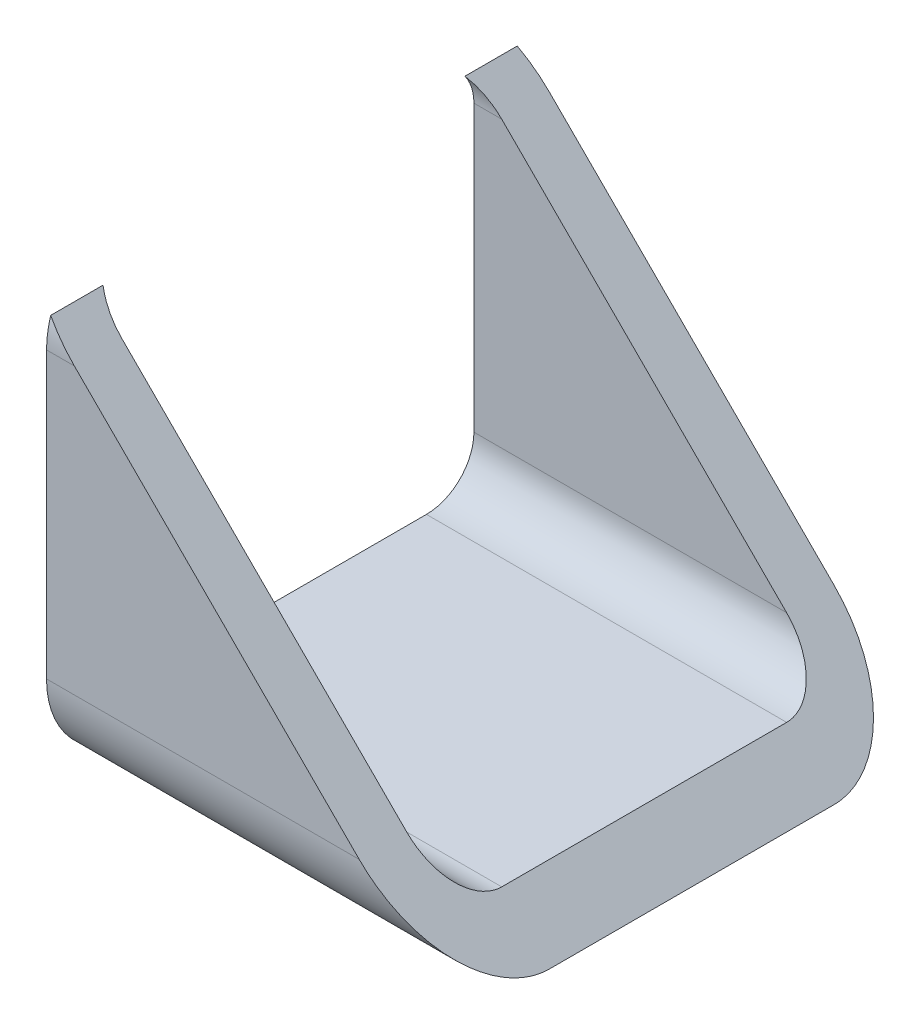
ISO-10303-21;
HEADER;
FILE_DESCRIPTION(('STEP AP214'),'2;1');
FILE_NAME('part.step','',(''),(''),'','','');
FILE_SCHEMA(('AUTOMOTIVE_DESIGN { 1 0 10303 214 1 1 1 1 }'));
ENDSEC;
DATA;
#1=APPLICATION_CONTEXT('core data for automotive mechanical design processes');
#2=APPLICATION_PROTOCOL_DEFINITION('international standard','automotive_design',2000,#1);
#3=PRODUCT_CONTEXT('',#1,'mechanical');
#4=PRODUCT('Part','Part','',(#3));
#5=PRODUCT_RELATED_PRODUCT_CATEGORY('part','',(#4));
#6=PRODUCT_DEFINITION_FORMATION('','',#4);
#7=PRODUCT_DEFINITION_CONTEXT('part definition',#1,'design');
#8=PRODUCT_DEFINITION('design','',#6,#7);
#9=PRODUCT_DEFINITION_SHAPE('','',#8);
#10=(LENGTH_UNIT() NAMED_UNIT(*) SI_UNIT(.MILLI.,.METRE.));
#11=(NAMED_UNIT(*) PLANE_ANGLE_UNIT() SI_UNIT($,.RADIAN.));
#12=(NAMED_UNIT(*) SI_UNIT($,.STERADIAN.) SOLID_ANGLE_UNIT());
#13=UNCERTAINTY_MEASURE_WITH_UNIT(LENGTH_MEASURE(1.E-05),#10,'distance_accuracy_value','');
#14=(GEOMETRIC_REPRESENTATION_CONTEXT(3) GLOBAL_UNCERTAINTY_ASSIGNED_CONTEXT((#13)) GLOBAL_UNIT_ASSIGNED_CONTEXT((#10,
#11,#12)) REPRESENTATION_CONTEXT('',''));
#15=CARTESIAN_POINT('',(0.,0.,0.));
#16=DIRECTION('',(0.,0.,1.));
#17=DIRECTION('',(1.,0.,0.));
#18=AXIS2_PLACEMENT_3D('',#15,#16,#17);
#19=CARTESIAN_POINT('',(40.,12.,-12.));
#20=DIRECTION('',(-1.,0.,0.));
#21=DIRECTION('',(0.,0.,1.));
#22=AXIS2_PLACEMENT_3D('',#19,#20,#21);
#23=CYLINDRICAL_SURFACE('',#22,8.);
#24=CARTESIAN_POINT('',(0.,12.,-12.));
#25=DIRECTION('',(1.,0.,0.));
#26=DIRECTION('',(0.,0.,-1.));
#27=AXIS2_PLACEMENT_3D('',#24,#25,#26);
#28=CIRCLE('',#27,8.);
#29=CARTESIAN_POINT('',(0.,12.,-20.));
#30=VERTEX_POINT('',#29);
#31=CARTESIAN_POINT('',(0.,14.3431457505076,-19.6491612606794));
#32=VERTEX_POINT('',#31);
#33=EDGE_CURVE('E186',#30,#32,#28,.T.);
#34=ORIENTED_EDGE('',*,*,#33,.T.);
#35=CARTESIAN_POINT('',(2.34314575050762,12.,-12.));
#36=DIRECTION('',(-0.707106781186547,-0.707106781186548,0.));
#37=DIRECTION('',(-0.707106781186548,0.707106781186547,0.));
#38=AXIS2_PLACEMENT_3D('',#35,#36,#37);
#39=ELLIPSE('',#38,11.3137084989848,8.);
#40=CARTESIAN_POINT('',(2.34314575050762,12.,-20.));
#41=VERTEX_POINT('',#40);
#42=EDGE_CURVE('E79',#41,#32,#39,.F.);
#43=ORIENTED_EDGE('',*,*,#42,.F.);
#44=DIRECTION('',(-1.,0.,0.));
#45=VECTOR('',#44,1.);
#46=CARTESIAN_POINT('',(40.,12.,-20.));
#47=LINE('',#46,#45);
#48=EDGE_CURVE('E86',#41,#30,#47,.T.);
#49=ORIENTED_EDGE('',*,*,#48,.T.);
#50=EDGE_LOOP('',(#34,#43,#49));
#51=FACE_BOUND('',#50,.T.);
#52=ADVANCED_FACE('F62',(#51),#23,.T.);
#53=CARTESIAN_POINT('',(40.,12.,12.));
#54=DIRECTION('',(-1.,0.,0.));
#55=DIRECTION('',(0.,0.,1.));
#56=AXIS2_PLACEMENT_3D('',#53,#54,#55);
#57=CYLINDRICAL_SURFACE('',#56,8.);
#58=DIRECTION('',(-1.,0.,0.));
#59=VECTOR('',#58,1.);
#60=CARTESIAN_POINT('',(40.,12.,20.));
#61=LINE('',#60,#59);
#62=CARTESIAN_POINT('',(2.34314575050762,12.,20.));
#63=VERTEX_POINT('',#62);
#64=CARTESIAN_POINT('',(0.,12.,20.));
#65=VERTEX_POINT('',#64);
#66=EDGE_CURVE('E12',#63,#65,#61,.T.);
#67=ORIENTED_EDGE('',*,*,#66,.F.);
#68=CARTESIAN_POINT('',(2.34314575050762,12.,12.));
#69=DIRECTION('',(-0.707106781186547,-0.707106781186548,0.));
#70=DIRECTION('',(-0.707106781186548,0.707106781186547,0.));
#71=AXIS2_PLACEMENT_3D('',#68,#69,#70);
#72=ELLIPSE('',#71,11.3137084989848,8.);
#73=CARTESIAN_POINT('',(0.,14.3431457505076,19.6491612606794));
#74=VERTEX_POINT('',#73);
#75=EDGE_CURVE('E163',#74,#63,#72,.F.);
#76=ORIENTED_EDGE('',*,*,#75,.F.);
#77=CARTESIAN_POINT('',(0.,12.,12.));
#78=DIRECTION('',(1.,0.,0.));
#79=DIRECTION('',(0.,0.,-1.));
#80=AXIS2_PLACEMENT_3D('',#77,#78,#79);
#81=CIRCLE('',#80,8.);
#82=EDGE_CURVE('E182',#74,#65,#81,.T.);
#83=ORIENTED_EDGE('',*,*,#82,.T.);
#84=EDGE_LOOP('',(#67,#76,#83));
#85=FACE_BOUND('',#84,.T.);
#86=ADVANCED_FACE('F181',(#85),#57,.T.);
#87=CARTESIAN_POINT('',(40.,-12.,20.));
#88=DIRECTION('',(0.,0.,-1.));
#89=DIRECTION('',(-1.,0.,0.));
#90=AXIS2_PLACEMENT_3D('',#87,#88,#89);
#91=PLANE('',#90);
#92=DIRECTION('',(-1.,0.,0.));
#93=VECTOR('',#92,1.);
#94=CARTESIAN_POINT('',(40.,-12.,20.));
#95=LINE('',#94,#93);
#96=CARTESIAN_POINT('',(26.3431457505076,-12.,20.));
#97=VERTEX_POINT('',#96);
#98=CARTESIAN_POINT('',(0.,-12.,20.));
#99=VERTEX_POINT('',#98);
#100=EDGE_CURVE('E71',#97,#99,#95,.T.);
#101=ORIENTED_EDGE('',*,*,#100,.F.);
#102=DIRECTION('',(0.707106781186548,-0.707106781186547,0.));
#103=VECTOR('',#102,1.);
#104=CARTESIAN_POINT('',(-9.65685424949238,24.,20.));
#105=LINE('',#104,#103);
#106=EDGE_CURVE('E166',#63,#97,#105,.T.);
#107=ORIENTED_EDGE('',*,*,#106,.F.);
#108=ORIENTED_EDGE('',*,*,#66,.T.);
#109=DIRECTION('',(0.,-1.,0.));
#110=VECTOR('',#109,1.);
#111=CARTESIAN_POINT('',(0.,-12.,20.));
#112=LINE('',#111,#110);
#113=EDGE_CURVE('E185',#65,#99,#112,.T.);
#114=ORIENTED_EDGE('',*,*,#113,.T.);
#115=EDGE_LOOP('',(#101,#107,#108,#114));
#116=FACE_BOUND('',#115,.T.);
#117=ADVANCED_FACE('F178',(#116),#91,.F.);
#118=CARTESIAN_POINT('',(40.,-12.,12.));
#119=DIRECTION('',(-1.,0.,0.));
#120=DIRECTION('',(0.,0.,1.));
#121=AXIS2_PLACEMENT_3D('',#118,#119,#120);
#122=CYLINDRICAL_SURFACE('',#121,8.);
#123=DIRECTION('',(-1.,0.,0.));
#124=VECTOR('',#123,1.);
#125=CARTESIAN_POINT('',(40.,-20.,12.));
#126=LINE('',#125,#124);
#127=CARTESIAN_POINT('',(34.3431457505076,-20.,12.));
#128=VERTEX_POINT('',#127);
#129=CARTESIAN_POINT('',(0.,-20.,12.));
#130=VERTEX_POINT('',#129);
#131=EDGE_CURVE('E211',#128,#130,#126,.T.);
#132=ORIENTED_EDGE('',*,*,#131,.F.);
#133=CARTESIAN_POINT('',(26.3431457505076,-12.,12.));
#134=DIRECTION('',(-0.707106781186547,-0.707106781186548,0.));
#135=DIRECTION('',(-0.707106781186548,0.707106781186547,0.));
#136=AXIS2_PLACEMENT_3D('',#133,#134,#135);
#137=ELLIPSE('',#136,11.3137084989848,8.);
#138=EDGE_CURVE('E174',#97,#128,#137,.F.);
#139=ORIENTED_EDGE('',*,*,#138,.F.);
#140=ORIENTED_EDGE('',*,*,#100,.T.);
#141=CARTESIAN_POINT('',(0.,-12.,12.));
#142=DIRECTION('',(1.,0.,0.));
#143=DIRECTION('',(0.,0.,-1.));
#144=AXIS2_PLACEMENT_3D('',#141,#142,#143);
#145=CIRCLE('',#144,8.);
#146=EDGE_CURVE('E192',#99,#130,#145,.T.);
#147=ORIENTED_EDGE('',*,*,#146,.T.);
#148=EDGE_LOOP('',(#132,#139,#140,#147));
#149=FACE_BOUND('',#148,.T.);
#150=ADVANCED_FACE('F423',(#149),#122,.T.);
#151=CARTESIAN_POINT('',(40.,-20.,12.));
#152=DIRECTION('',(0.,1.,0.));
#153=DIRECTION('',(0.,0.,1.));
#154=AXIS2_PLACEMENT_3D('',#151,#152,#153);
#155=PLANE('',#154);
#156=DIRECTION('',(-1.,0.,0.));
#157=VECTOR('',#156,1.);
#158=CARTESIAN_POINT('',(40.,-20.,-12.));
#159=LINE('',#158,#157);
#160=CARTESIAN_POINT('',(34.3431457505076,-20.,-12.));
#161=VERTEX_POINT('',#160);
#162=CARTESIAN_POINT('',(0.,-20.,-12.));
#163=VERTEX_POINT('',#162);
#164=EDGE_CURVE('E209',#161,#163,#159,.T.);
#165=ORIENTED_EDGE('',*,*,#164,.F.);
#166=DIRECTION('',(0.,0.,-1.));
#167=VECTOR('',#166,1.);
#168=CARTESIAN_POINT('',(34.3431457505076,-20.,-20.001));
#169=LINE('',#168,#167);
#170=EDGE_CURVE('E286',#128,#161,#169,.T.);
#171=ORIENTED_EDGE('',*,*,#170,.F.);
#172=ORIENTED_EDGE('',*,*,#131,.T.);
#173=DIRECTION('',(0.,0.,-1.));
#174=VECTOR('',#173,1.);
#175=CARTESIAN_POINT('',(0.,-20.,12.));
#176=LINE('',#175,#174);
#177=EDGE_CURVE('E194',#130,#163,#176,.T.);
#178=ORIENTED_EDGE('',*,*,#177,.T.);
#179=EDGE_LOOP('',(#165,#171,#172,#178));
#180=FACE_BOUND('',#179,.T.);
#181=ADVANCED_FACE('F412',(#180),#155,.F.);
#182=CARTESIAN_POINT('',(40.,-12.,-12.));
#183=DIRECTION('',(-1.,0.,0.));
#184=DIRECTION('',(0.,0.,1.));
#185=AXIS2_PLACEMENT_3D('',#182,#183,#184);
#186=CYLINDRICAL_SURFACE('',#185,8.);
#187=DIRECTION('',(-1.,0.,0.));
#188=VECTOR('',#187,1.);
#189=CARTESIAN_POINT('',(40.,-12.,-20.));
#190=LINE('',#189,#188);
#191=CARTESIAN_POINT('',(26.3431457505076,-12.,-20.));
#192=VERTEX_POINT('',#191);
#193=CARTESIAN_POINT('',(0.,-12.,-20.));
#194=VERTEX_POINT('',#193);
#195=EDGE_CURVE('E207',#192,#194,#190,.T.);
#196=ORIENTED_EDGE('',*,*,#195,.F.);
#197=CARTESIAN_POINT('',(26.3431457505076,-12.,-12.));
#198=DIRECTION('',(-0.707106781186547,-0.707106781186548,0.));
#199=DIRECTION('',(-0.707106781186548,0.707106781186547,0.));
#200=AXIS2_PLACEMENT_3D('',#197,#198,#199);
#201=ELLIPSE('',#200,11.3137084989848,8.);
#202=EDGE_CURVE('E284',#161,#192,#201,.F.);
#203=ORIENTED_EDGE('',*,*,#202,.F.);
#204=ORIENTED_EDGE('',*,*,#164,.T.);
#205=CARTESIAN_POINT('',(0.,-12.,-12.));
#206=DIRECTION('',(1.,0.,0.));
#207=DIRECTION('',(0.,0.,-1.));
#208=AXIS2_PLACEMENT_3D('',#205,#206,#207);
#209=CIRCLE('',#208,8.);
#210=EDGE_CURVE('E200',#163,#194,#209,.T.);
#211=ORIENTED_EDGE('',*,*,#210,.T.);
#212=EDGE_LOOP('',(#196,#203,#204,#211));
#213=FACE_BOUND('',#212,.T.);
#214=ADVANCED_FACE('F404',(#213),#186,.T.);
#215=CARTESIAN_POINT('',(40.,12.,12.));
#216=DIRECTION('',(-1.,0.,0.));
#217=DIRECTION('',(0.,0.,1.));
#218=AXIS2_PLACEMENT_3D('',#215,#216,#217);
#219=CYLINDRICAL_SURFACE('',#218,4.);
#220=CARTESIAN_POINT('',(2.34314575050762,12.,12.));
#221=DIRECTION('',(-0.707106781186547,-0.707106781186548,0.));
#222=DIRECTION('',(-0.707106781186548,0.707106781186547,0.));
#223=AXIS2_PLACEMENT_3D('',#220,#221,#222);
#224=ELLIPSE('',#223,5.65685424949238,4.);
#225=CARTESIAN_POINT('',(0.,14.3431457505076,15.2418618094975));
#226=VERTEX_POINT('',#225);
#227=CARTESIAN_POINT('',(2.34314575050762,12.,16.));
#228=VERTEX_POINT('',#227);
#229=EDGE_CURVE('E265',#226,#228,#224,.F.);
#230=ORIENTED_EDGE('',*,*,#229,.T.);
#231=DIRECTION('',(-1.,0.,0.));
#232=VECTOR('',#231,1.);
#233=CARTESIAN_POINT('',(40.,12.,16.));
#234=LINE('',#233,#232);
#235=CARTESIAN_POINT('',(0.,12.,16.));
#236=VERTEX_POINT('',#235);
#237=EDGE_CURVE('E205',#228,#236,#234,.T.);
#238=ORIENTED_EDGE('',*,*,#237,.T.);
#239=CARTESIAN_POINT('',(0.,12.,12.));
#240=DIRECTION('',(1.,0.,0.));
#241=DIRECTION('',(0.,0.,-1.));
#242=AXIS2_PLACEMENT_3D('',#239,#240,#241);
#243=CIRCLE('',#242,4.);
#244=EDGE_CURVE('E241',#226,#236,#243,.T.);
#245=ORIENTED_EDGE('',*,*,#244,.F.);
#246=EDGE_LOOP('',(#230,#238,#245));
#247=FACE_BOUND('',#246,.T.);
#248=ADVANCED_FACE('F64',(#247),#219,.F.);
#249=CARTESIAN_POINT('',(40.,12.,-12.));
#250=DIRECTION('',(-1.,0.,0.));
#251=DIRECTION('',(0.,0.,1.));
#252=AXIS2_PLACEMENT_3D('',#249,#250,#251);
#253=CYLINDRICAL_SURFACE('',#252,4.);
#254=CARTESIAN_POINT('',(2.34314575050762,12.,-12.));
#255=DIRECTION('',(-0.707106781186547,-0.707106781186548,0.));
#256=DIRECTION('',(-0.707106781186548,0.707106781186547,0.));
#257=AXIS2_PLACEMENT_3D('',#254,#255,#256);
#258=ELLIPSE('',#257,5.65685424949238,4.);
#259=CARTESIAN_POINT('',(2.34314575050762,12.,-16.));
#260=VERTEX_POINT('',#259);
#261=CARTESIAN_POINT('',(0.,14.3431457505076,-15.2418618094975));
#262=VERTEX_POINT('',#261);
#263=EDGE_CURVE('E240',#260,#262,#258,.F.);
#264=ORIENTED_EDGE('',*,*,#263,.T.);
#265=CARTESIAN_POINT('',(0.,12.,-12.));
#266=DIRECTION('',(1.,0.,0.));
#267=DIRECTION('',(0.,0.,-1.));
#268=AXIS2_PLACEMENT_3D('',#265,#266,#267);
#269=CIRCLE('',#268,4.);
#270=CARTESIAN_POINT('',(0.,12.,-16.));
#271=VERTEX_POINT('',#270);
#272=EDGE_CURVE('E238',#271,#262,#269,.T.);
#273=ORIENTED_EDGE('',*,*,#272,.F.);
#274=DIRECTION('',(-1.,0.,0.));
#275=VECTOR('',#274,1.);
#276=CARTESIAN_POINT('',(40.,12.,-16.));
#277=LINE('',#276,#275);
#278=EDGE_CURVE('E66',#260,#271,#277,.T.);
#279=ORIENTED_EDGE('',*,*,#278,.F.);
#280=EDGE_LOOP('',(#264,#273,#279));
#281=FACE_BOUND('',#280,.T.);
#282=ADVANCED_FACE('F239',(#281),#253,.F.);
#283=CARTESIAN_POINT('',(40.,12.,-16.));
#284=DIRECTION('',(0.,0.,1.));
#285=DIRECTION('',(1.,0.,0.));
#286=AXIS2_PLACEMENT_3D('',#283,#284,#285);
#287=PLANE('',#286);
#288=DIRECTION('',(-0.707106781186548,0.707106781186547,0.));
#289=VECTOR('',#288,1.);
#290=CARTESIAN_POINT('',(-9.65685424949238,24.,-16.));
#291=LINE('',#290,#289);
#292=CARTESIAN_POINT('',(26.3431457505076,-12.,-16.));
#293=VERTEX_POINT('',#292);
#294=EDGE_CURVE('E234',#293,#260,#291,.T.);
#295=ORIENTED_EDGE('',*,*,#294,.T.);
#296=ORIENTED_EDGE('',*,*,#278,.T.);
#297=DIRECTION('',(0.,1.,0.));
#298=VECTOR('',#297,1.);
#299=CARTESIAN_POINT('',(0.,12.,-16.));
#300=LINE('',#299,#298);
#301=CARTESIAN_POINT('',(0.,-12.,-16.));
#302=VERTEX_POINT('',#301);
#303=EDGE_CURVE('E232',#302,#271,#300,.T.);
#304=ORIENTED_EDGE('',*,*,#303,.F.);
#305=DIRECTION('',(-1.,0.,0.));
#306=VECTOR('',#305,1.);
#307=CARTESIAN_POINT('',(40.,-12.,-16.));
#308=LINE('',#307,#306);
#309=EDGE_CURVE('E220',#293,#302,#308,.T.);
#310=ORIENTED_EDGE('',*,*,#309,.F.);
#311=EDGE_LOOP('',(#295,#296,#304,#310));
#312=FACE_BOUND('',#311,.T.);
#313=ADVANCED_FACE('F230',(#312),#287,.T.);
#314=CARTESIAN_POINT('',(40.,-12.,-12.));
#315=DIRECTION('',(-1.,0.,0.));
#316=DIRECTION('',(0.,0.,1.));
#317=AXIS2_PLACEMENT_3D('',#314,#315,#316);
#318=CYLINDRICAL_SURFACE('',#317,4.);
#319=CARTESIAN_POINT('',(26.3431457505076,-12.,-12.));
#320=DIRECTION('',(-0.707106781186547,-0.707106781186548,0.));
#321=DIRECTION('',(-0.707106781186548,0.707106781186547,0.));
#322=AXIS2_PLACEMENT_3D('',#319,#320,#321);
#323=ELLIPSE('',#322,5.65685424949238,4.);
#324=CARTESIAN_POINT('',(30.3431457505076,-16.,-12.));
#325=VERTEX_POINT('',#324);
#326=EDGE_CURVE('E280',#325,#293,#323,.F.);
#327=ORIENTED_EDGE('',*,*,#326,.T.);
#328=ORIENTED_EDGE('',*,*,#309,.T.);
#329=CARTESIAN_POINT('',(0.,-12.,-12.));
#330=DIRECTION('',(1.,0.,0.));
#331=DIRECTION('',(0.,0.,-1.));
#332=AXIS2_PLACEMENT_3D('',#329,#330,#331);
#333=CIRCLE('',#332,4.);
#334=CARTESIAN_POINT('',(0.,-16.,-12.));
#335=VERTEX_POINT('',#334);
#336=EDGE_CURVE('E244',#335,#302,#333,.T.);
#337=ORIENTED_EDGE('',*,*,#336,.F.);
#338=DIRECTION('',(-1.,0.,0.));
#339=VECTOR('',#338,1.);
#340=CARTESIAN_POINT('',(40.,-16.,-12.));
#341=LINE('',#340,#339);
#342=EDGE_CURVE('E219',#325,#335,#341,.T.);
#343=ORIENTED_EDGE('',*,*,#342,.F.);
#344=EDGE_LOOP('',(#327,#328,#337,#343));
#345=FACE_BOUND('',#344,.T.);
#346=ADVANCED_FACE('F300',(#345),#318,.F.);
#347=CARTESIAN_POINT('',(40.,-16.,12.));
#348=DIRECTION('',(0.,1.,0.));
#349=DIRECTION('',(0.,0.,1.));
#350=AXIS2_PLACEMENT_3D('',#347,#348,#349);
#351=PLANE('',#350);
#352=DIRECTION('',(0.,0.,-1.));
#353=VECTOR('',#352,1.);
#354=CARTESIAN_POINT('',(30.3431457505076,-16.,-20.001));
#355=LINE('',#354,#353);
#356=CARTESIAN_POINT('',(30.3431457505076,-16.,12.));
#357=VERTEX_POINT('',#356);
#358=EDGE_CURVE('E277',#357,#325,#355,.T.);
#359=ORIENTED_EDGE('',*,*,#358,.T.);
#360=ORIENTED_EDGE('',*,*,#342,.T.);
#361=DIRECTION('',(0.,0.,-1.));
#362=VECTOR('',#361,1.);
#363=CARTESIAN_POINT('',(0.,-16.,12.));
#364=LINE('',#363,#362);
#365=CARTESIAN_POINT('',(0.,-16.,12.));
#366=VERTEX_POINT('',#365);
#367=EDGE_CURVE('E246',#366,#335,#364,.T.);
#368=ORIENTED_EDGE('',*,*,#367,.F.);
#369=DIRECTION('',(-1.,0.,0.));
#370=VECTOR('',#369,1.);
#371=CARTESIAN_POINT('',(40.,-16.,12.));
#372=LINE('',#371,#370);
#373=EDGE_CURVE('E217',#357,#366,#372,.T.);
#374=ORIENTED_EDGE('',*,*,#373,.F.);
#375=EDGE_LOOP('',(#359,#360,#368,#374));
#376=FACE_BOUND('',#375,.T.);
#377=ADVANCED_FACE('F298',(#376),#351,.T.);
#378=CARTESIAN_POINT('',(40.,-12.,12.));
#379=DIRECTION('',(-1.,0.,0.));
#380=DIRECTION('',(0.,0.,1.));
#381=AXIS2_PLACEMENT_3D('',#378,#379,#380);
#382=CYLINDRICAL_SURFACE('',#381,4.);
#383=CARTESIAN_POINT('',(26.3431457505076,-12.,12.));
#384=DIRECTION('',(-0.707106781186547,-0.707106781186548,0.));
#385=DIRECTION('',(-0.707106781186548,0.707106781186547,0.));
#386=AXIS2_PLACEMENT_3D('',#383,#384,#385);
#387=ELLIPSE('',#386,5.65685424949238,4.);
#388=CARTESIAN_POINT('',(26.3431457505076,-12.,16.));
#389=VERTEX_POINT('',#388);
#390=EDGE_CURVE('E272',#389,#357,#387,.F.);
#391=ORIENTED_EDGE('',*,*,#390,.T.);
#392=ORIENTED_EDGE('',*,*,#373,.T.);
#393=CARTESIAN_POINT('',(0.,-12.,12.));
#394=DIRECTION('',(1.,0.,0.));
#395=DIRECTION('',(0.,0.,-1.));
#396=AXIS2_PLACEMENT_3D('',#393,#394,#395);
#397=CIRCLE('',#396,4.);
#398=CARTESIAN_POINT('',(0.,-12.,16.));
#399=VERTEX_POINT('',#398);
#400=EDGE_CURVE('E251',#399,#366,#397,.T.);
#401=ORIENTED_EDGE('',*,*,#400,.F.);
#402=DIRECTION('',(-1.,0.,0.));
#403=VECTOR('',#402,1.);
#404=CARTESIAN_POINT('',(40.,-12.,16.));
#405=LINE('',#404,#403);
#406=EDGE_CURVE('E215',#389,#399,#405,.T.);
#407=ORIENTED_EDGE('',*,*,#406,.F.);
#408=EDGE_LOOP('',(#391,#392,#401,#407));
#409=FACE_BOUND('',#408,.T.);
#410=ADVANCED_FACE('F294',(#409),#382,.F.);
#411=CARTESIAN_POINT('',(40.,-12.,16.));
#412=DIRECTION('',(0.,0.,-1.));
#413=DIRECTION('',(-1.,0.,0.));
#414=AXIS2_PLACEMENT_3D('',#411,#412,#413);
#415=PLANE('',#414);
#416=DIRECTION('',(0.707106781186548,-0.707106781186547,0.));
#417=VECTOR('',#416,1.);
#418=CARTESIAN_POINT('',(-9.65685424949238,24.,16.));
#419=LINE('',#418,#417);
#420=EDGE_CURVE('E267',#228,#389,#419,.T.);
#421=ORIENTED_EDGE('',*,*,#420,.T.);
#422=ORIENTED_EDGE('',*,*,#406,.T.);
#423=DIRECTION('',(0.,-1.,0.));
#424=VECTOR('',#423,1.);
#425=CARTESIAN_POINT('',(0.,-12.,16.));
#426=LINE('',#425,#424);
#427=EDGE_CURVE('E254',#236,#399,#426,.T.);
#428=ORIENTED_EDGE('',*,*,#427,.F.);
#429=ORIENTED_EDGE('',*,*,#237,.F.);
#430=EDGE_LOOP('',(#421,#422,#428,#429));
#431=FACE_BOUND('',#430,.T.);
#432=ADVANCED_FACE('F290',(#431),#415,.T.);
#433=CARTESIAN_POINT('',(40.,12.,-20.));
#434=DIRECTION('',(0.,0.,1.));
#435=DIRECTION('',(1.,0.,0.));
#436=AXIS2_PLACEMENT_3D('',#433,#434,#435);
#437=PLANE('',#436);
#438=ORIENTED_EDGE('',*,*,#48,.F.);
#439=DIRECTION('',(-0.707106781186548,0.707106781186547,0.));
#440=VECTOR('',#439,1.);
#441=CARTESIAN_POINT('',(-9.65685424949238,24.,-20.));
#442=LINE('',#441,#440);
#443=EDGE_CURVE('E261',#192,#41,#442,.T.);
#444=ORIENTED_EDGE('',*,*,#443,.F.);
#445=ORIENTED_EDGE('',*,*,#195,.T.);
#446=DIRECTION('',(0.,1.,0.));
#447=VECTOR('',#446,1.);
#448=CARTESIAN_POINT('',(0.,12.,-20.));
#449=LINE('',#448,#447);
#450=EDGE_CURVE('E203',#194,#30,#449,.T.);
#451=ORIENTED_EDGE('',*,*,#450,.T.);
#452=EDGE_LOOP('',(#438,#444,#445,#451));
#453=FACE_BOUND('',#452,.T.);
#454=ADVANCED_FACE('F319',(#453),#437,.F.);
#455=CARTESIAN_POINT('',(0.,12.,-12.));
#456=DIRECTION('',(1.,0.,0.));
#457=DIRECTION('',(0.,0.,-1.));
#458=AXIS2_PLACEMENT_3D('',#455,#456,#457);
#459=PLANE('',#458);
#460=ORIENTED_EDGE('',*,*,#82,.F.);
#461=DIRECTION('',(0.,0.,1.));
#462=VECTOR('',#461,1.);
#463=CARTESIAN_POINT('',(0.,14.3431457505076,-20.001));
#464=LINE('',#463,#462);
#465=EDGE_CURVE('E169',#226,#74,#464,.T.);
#466=ORIENTED_EDGE('',*,*,#465,.F.);
#467=ORIENTED_EDGE('',*,*,#244,.T.);
#468=ORIENTED_EDGE('',*,*,#427,.T.);
#469=ORIENTED_EDGE('',*,*,#400,.T.);
#470=ORIENTED_EDGE('',*,*,#367,.T.);
#471=ORIENTED_EDGE('',*,*,#336,.T.);
#472=ORIENTED_EDGE('',*,*,#303,.T.);
#473=ORIENTED_EDGE('',*,*,#272,.T.);
#474=EDGE_CURVE('E259',#32,#262,#464,.T.);
#475=ORIENTED_EDGE('',*,*,#474,.F.);
#476=ORIENTED_EDGE('',*,*,#33,.F.);
#477=ORIENTED_EDGE('',*,*,#450,.F.);
#478=ORIENTED_EDGE('',*,*,#210,.F.);
#479=ORIENTED_EDGE('',*,*,#177,.F.);
#480=ORIENTED_EDGE('',*,*,#146,.F.);
#481=ORIENTED_EDGE('',*,*,#113,.F.);
#482=EDGE_LOOP('',(#460,#466,#467,#468,#469,#470,#471,#472,#473,#475,#476,#477,#478,#479,#480,#481));
#483=FACE_BOUND('',#482,.T.);
#484=ADVANCED_FACE('F189',(#483),#459,.F.);
#485=CARTESIAN_POINT('',(-9.65685424949238,24.,-20.001));
#486=DIRECTION('',(-0.707106781186547,-0.707106781186548,0.));
#487=DIRECTION('',(0.707106781186548,-0.707106781186547,0.));
#488=AXIS2_PLACEMENT_3D('',#485,#486,#487);
#489=PLANE('',#488);
#490=ORIENTED_EDGE('',*,*,#138,.T.);
#491=ORIENTED_EDGE('',*,*,#170,.T.);
#492=ORIENTED_EDGE('',*,*,#202,.T.);
#493=ORIENTED_EDGE('',*,*,#443,.T.);
#494=ORIENTED_EDGE('',*,*,#42,.T.);
#495=ORIENTED_EDGE('',*,*,#474,.T.);
#496=ORIENTED_EDGE('',*,*,#263,.F.);
#497=ORIENTED_EDGE('',*,*,#294,.F.);
#498=ORIENTED_EDGE('',*,*,#326,.F.);
#499=ORIENTED_EDGE('',*,*,#358,.F.);
#500=ORIENTED_EDGE('',*,*,#390,.F.);
#501=ORIENTED_EDGE('',*,*,#420,.F.);
#502=ORIENTED_EDGE('',*,*,#229,.F.);
#503=ORIENTED_EDGE('',*,*,#465,.T.);
#504=ORIENTED_EDGE('',*,*,#75,.T.);
#505=ORIENTED_EDGE('',*,*,#106,.T.);
#506=EDGE_LOOP('',(#490,#491,#492,#493,#494,#495,#496,#497,#498,#499,#500,#501,#502,#503,#504,#505));
#507=FACE_BOUND('',#506,.T.);
#508=ADVANCED_FACE('F165',(#507),#489,.F.);
#509=CLOSED_SHELL('',(#52,#86,#117,#150,#181,#214,#248,#282,#313,#346,#377,#410,#432,#454,#484,#508));
#510=MANIFOLD_SOLID_BREP('B2',#509);
#511=ADVANCED_BREP_SHAPE_REPRESENTATION('',(#18,#510),#14);
#512=SHAPE_DEFINITION_REPRESENTATION(#9,#511);
ENDSEC;
END-ISO-10303-21;
